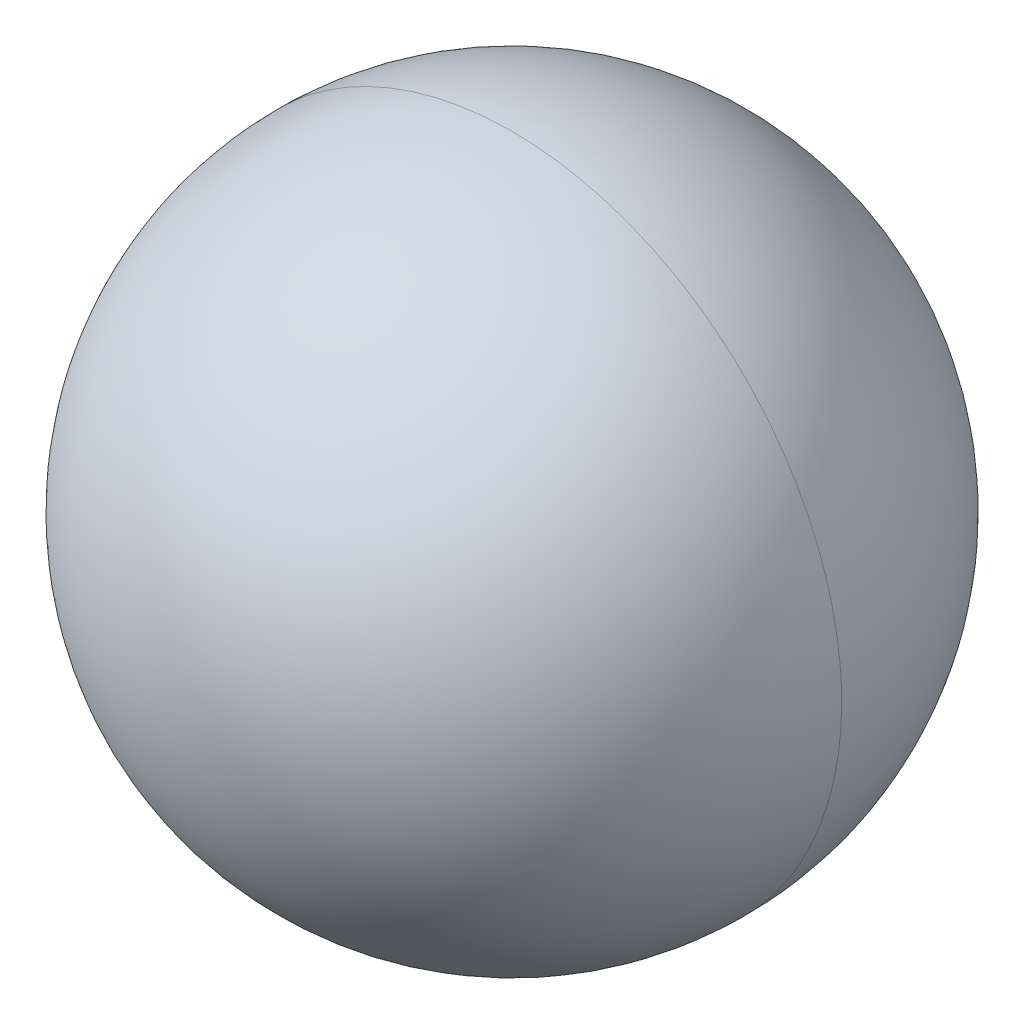
ISO-10303-21;
HEADER;
FILE_DESCRIPTION(('STEP AP214'),'2;1');
FILE_NAME('part.step','',(''),(''),'','','');
FILE_SCHEMA(('AUTOMOTIVE_DESIGN { 1 0 10303 214 1 1 1 1 }'));
ENDSEC;
DATA;
#1=APPLICATION_CONTEXT('core data for automotive mechanical design processes');
#2=APPLICATION_PROTOCOL_DEFINITION('international standard','automotive_design',2000,#1);
#3=PRODUCT_CONTEXT('',#1,'mechanical');
#4=PRODUCT('Part','Part','',(#3));
#5=PRODUCT_RELATED_PRODUCT_CATEGORY('part','',(#4));
#6=PRODUCT_DEFINITION_FORMATION('','',#4);
#7=PRODUCT_DEFINITION_CONTEXT('part definition',#1,'design');
#8=PRODUCT_DEFINITION('design','',#6,#7);
#9=PRODUCT_DEFINITION_SHAPE('','',#8);
#10=(LENGTH_UNIT() NAMED_UNIT(*) SI_UNIT(.MILLI.,.METRE.));
#11=(NAMED_UNIT(*) PLANE_ANGLE_UNIT() SI_UNIT($,.RADIAN.));
#12=(NAMED_UNIT(*) SI_UNIT($,.STERADIAN.) SOLID_ANGLE_UNIT());
#13=UNCERTAINTY_MEASURE_WITH_UNIT(LENGTH_MEASURE(1.E-05),#10,'distance_accuracy_value','');
#14=(GEOMETRIC_REPRESENTATION_CONTEXT(3) GLOBAL_UNCERTAINTY_ASSIGNED_CONTEXT((#13)) GLOBAL_UNIT_ASSIGNED_CONTEXT((#10,
#11,#12)) REPRESENTATION_CONTEXT('',''));
#15=CARTESIAN_POINT('',(0.,0.,0.));
#16=DIRECTION('',(0.,0.,1.));
#17=DIRECTION('',(1.,0.,0.));
#18=AXIS2_PLACEMENT_3D('',#15,#16,#17);
#19=CARTESIAN_POINT('',(0.,0.,0.));
#20=DIRECTION('',(1.,0.,0.));
#21=DIRECTION('',(0.,0.,1.));
#22=AXIS2_PLACEMENT_3D('',#19,#20,#21);
#23=SPHERICAL_SURFACE('',#22,1.2);
#24=CARTESIAN_POINT('',(0.,0.,0.));
#25=DIRECTION('',(0.,0.,1.));
#26=DIRECTION('',(0.,-1.,0.));
#27=AXIS2_PLACEMENT_3D('',#24,#25,#26);
#28=CIRCLE('',#27,1.2);
#29=CARTESIAN_POINT('',(-1.2,0.,0.));
#30=VERTEX_POINT('',#29);
#31=CARTESIAN_POINT('',(1.2,0.,0.));
#32=VERTEX_POINT('',#31);
#33=EDGE_CURVE('E11',#30,#32,#28,.T.);
#34=ORIENTED_EDGE('',*,*,#33,.F.);
#35=CARTESIAN_POINT('',(-1.2,0.,0.));
#36=CARTESIAN_POINT('',(-1.20000041650653,0.0196349739130671,0.));
#37=CARTESIAN_POINT('',(-1.19951810055018,0.0392699123855113,0.));
#38=CARTESIAN_POINT('',(-1.19759099434223,0.0784925060002896,0.));
#39=CARTESIAN_POINT('',(-1.19614620409062,0.0980801611426238,0.));
#40=CARTESIAN_POINT('',(-1.19229713992265,0.137160975648319,0.));
#41=CARTESIAN_POINT('',(-1.18989286600628,0.156654135011681,0.));
#42=CARTESIAN_POINT('',(-1.1841307579092,0.195499003681185,0.));
#43=CARTESIAN_POINT('',(-1.18077292372849,0.214850712987328,0.));
#44=CARTESIAN_POINT('',(-1.17311174923927,0.253366059851378,0.));
#45=CARTESIAN_POINT('',(-1.16880840893076,0.272529697409285,0.));
#46=CARTESIAN_POINT('',(-1.15926659873615,0.310622734358546,0.));
#47=CARTESIAN_POINT('',(-1.15402812885005,0.329552133749898,0.));
#48=CARTESIAN_POINT('',(-1.14262867690725,0.367131091660809,0.));
#49=CARTESIAN_POINT('',(-1.13646769485054,0.385780650180368,0.));
#50=CARTESIAN_POINT('',(-1.12323806158871,0.422754997960958,0.));
#51=CARTESIAN_POINT('',(-1.11616941038359,0.441079787221989,0.));
#52=CARTESIAN_POINT('',(-1.1011414676435,0.477360450454224,0.));
#53=CARTESIAN_POINT('',(-1.09318217610852,0.495316324425427,0.));
#54=CARTESIAN_POINT('',(-1.07639212738775,0.530815899807247,0.));
#55=CARTESIAN_POINT('',(-1.06756137020196,0.548359601217864,0.));
#56=CARTESIAN_POINT('',(-1.04904966423409,0.582992567164527,0.));
#57=CARTESIAN_POINT('',(-1.03936871545202,0.600081831700574,0.));
#58=CARTESIAN_POINT('',(-1.01917994854864,0.633764754363156,0.));
#59=CARTESIAN_POINT('',(-1.00867213042733,0.650358412489693,0.));
#60=CARTESIAN_POINT('',(-0.986854939098781,0.68301014675735,0.));
#61=CARTESIAN_POINT('',(-0.975545565891539,0.699068222898472,0.));
#62=CARTESIAN_POINT('',(-0.952152509662011,0.730610107883366,0.));
#63=CARTESIAN_POINT('',(-0.940068826639724,0.746093916727139,0.));
#64=CARTESIAN_POINT('',(-0.915156261430846,0.776449965265608,0.));
#65=CARTESIAN_POINT('',(-0.902327379244255,0.791322204960303,0.));
#66=CARTESIAN_POINT('',(-0.875955321607649,0.820419286672538,0.));
#67=CARTESIAN_POINT('',(-0.862412146157635,0.834644128690079,0.));
#68=CARTESIAN_POINT('',(-0.834644128690081,0.862412146157633,0.));
#69=CARTESIAN_POINT('',(-0.820419286672541,0.875955321607648,0.));
#70=CARTESIAN_POINT('',(-0.791322204960305,0.902327379244251,0.));
#71=CARTESIAN_POINT('',(-0.77644996526561,0.91515626143084,0.));
#72=CARTESIAN_POINT('',(-0.746093916727142,0.940068826639726,0.));
#73=CARTESIAN_POINT('',(-0.730610107883369,0.952152509662024,0.));
#74=CARTESIAN_POINT('',(-0.699068222898473,0.975545565891521,0.));
#75=CARTESIAN_POINT('',(-0.68301014675735,0.986854939098722,0.));
#76=CARTESIAN_POINT('',(-0.650358412489698,1.00867213042738,0.));
#77=CARTESIAN_POINT('',(-0.633764754363169,1.01917994854885,0.));
#78=CARTESIAN_POINT('',(-0.600081831700566,1.0393687154518,0.));
#79=CARTESIAN_POINT('',(-0.582992567164491,1.0490496642333,0.));
#80=CARTESIAN_POINT('',(-0.548359601217906,1.06756137020275,0.));
#81=CARTESIAN_POINT('',(-0.530815899807396,1.07639212739071,0.));
#82=CARTESIAN_POINT('',(-0.495316324425284,1.09318217610555,0.));
#83=CARTESIAN_POINT('',(-0.477360450453683,1.10114146763243,0.));
#84=CARTESIAN_POINT('',(-0.441079787222536,1.11616941039466,0.));
#85=CARTESIAN_POINT('',(-0.42275499796299,1.12323806163001,0.));
#86=CARTESIAN_POINT('',(-0.385780650178342,1.13646769480923,0.));
#87=CARTESIAN_POINT('',(-0.36713109165324,1.1426286767531,0.));
#88=CARTESIAN_POINT('',(-0.329552133757474,1.1540281290042,0.));
#89=CARTESIAN_POINT('',(-0.310622734386811,1.15926659931144,0.));
#90=CARTESIAN_POINT('',(-0.272529697381027,1.16880840835547,0.));
#91=CARTESIAN_POINT('',(-0.253366059745906,1.17311174709227,0.));
#92=CARTESIAN_POINT('',(-0.214850713092806,1.18077292587548,0.));
#93=CARTESIAN_POINT('',(-0.195499004074827,1.1841307659219,0.));
#94=CARTESIAN_POINT('',(-0.156654134618045,1.18989285799357,0.));
#95=CARTESIAN_POINT('',(-0.137160974179242,1.19229711001882,0.));
#96=CARTESIAN_POINT('',(-0.098080162611708,1.19614623399445,0.));
#97=CARTESIAN_POINT('',(-0.0784925114829768,1.19759110594482,0.));
#98=CARTESIAN_POINT('',(-0.0392699069028313,1.19951798894759,0.));
#99=CARTESIAN_POINT('',(-0.0196349534514168,1.2,0.));
#100=CARTESIAN_POINT('',(0.019634953451412,1.2,0.));
#101=CARTESIAN_POINT('',(0.0392699069028264,1.1995179889476,0.));
#102=CARTESIAN_POINT('',(0.078492511482972,1.19759110594482,0.));
#103=CARTESIAN_POINT('',(0.0980801626117031,1.19614623399445,0.));
#104=CARTESIAN_POINT('',(0.137160974179237,1.19229711001882,0.));
#105=CARTESIAN_POINT('',(0.156654134618041,1.18989285799357,0.));
#106=CARTESIAN_POINT('',(0.195499004074823,1.1841307659219,0.));
#107=CARTESIAN_POINT('',(0.214850713092802,1.18077292587549,0.));
#108=CARTESIAN_POINT('',(0.253366059745901,1.17311174709227,0.));
#109=CARTESIAN_POINT('',(0.272529697381022,1.16880840835547,0.));
#110=CARTESIAN_POINT('',(0.310622734386806,1.15926659931144,0.));
#111=CARTESIAN_POINT('',(0.329552133757469,1.1540281290042,0.));
#112=CARTESIAN_POINT('',(0.367131091653235,1.1426286767531,0.));
#113=CARTESIAN_POINT('',(0.385780650178338,1.13646769480924,0.));
#114=CARTESIAN_POINT('',(0.422754997962986,1.12323806163002,0.));
#115=CARTESIAN_POINT('',(0.441079787222532,1.11616941039466,0.));
#116=CARTESIAN_POINT('',(0.477360450453679,1.10114146763243,0.));
#117=CARTESIAN_POINT('',(0.49531632442528,1.09318217610555,0.));
#118=CARTESIAN_POINT('',(0.530815899807392,1.07639212739071,0.));
#119=CARTESIAN_POINT('',(0.548359601217902,1.06756137020275,0.));
#120=CARTESIAN_POINT('',(0.582992567164487,1.0490496642333,0.));
#121=CARTESIAN_POINT('',(0.600081831700561,1.03936871545181,0.));
#122=CARTESIAN_POINT('',(0.633764754363165,1.01917994854885,0.));
#123=CARTESIAN_POINT('',(0.650358412489694,1.00867213042739,0.));
#124=CARTESIAN_POINT('',(0.683010146757346,0.986854939098724,0.));
#125=CARTESIAN_POINT('',(0.69906822289847,0.975545565891524,0.));
#126=CARTESIAN_POINT('',(0.730610107883366,0.952152509662027,0.));
#127=CARTESIAN_POINT('',(0.746093916727138,0.940068826639729,0.));
#128=CARTESIAN_POINT('',(0.776449965265606,0.915156261430843,0.));
#129=CARTESIAN_POINT('',(0.791322204960302,0.902327379244255,0.));
#130=CARTESIAN_POINT('',(0.820419286672538,0.875955321607651,0.));
#131=CARTESIAN_POINT('',(0.834644128690078,0.862412146157637,0.));
#132=CARTESIAN_POINT('',(0.862412146157632,0.834644128690082,0.));
#133=CARTESIAN_POINT('',(0.875955321607646,0.820419286672542,0.));
#134=CARTESIAN_POINT('',(0.902327379244251,0.791322204960307,0.));
#135=CARTESIAN_POINT('',(0.915156261430843,0.776449965265611,0.));
#136=CARTESIAN_POINT('',(0.940068826639721,0.746093916727143,0.));
#137=CARTESIAN_POINT('',(0.952152509662008,0.730610107883369,0.));
#138=CARTESIAN_POINT('',(0.975545565891536,0.699068222898475,0.));
#139=CARTESIAN_POINT('',(0.986854939098778,0.683010146757354,0.));
#140=CARTESIAN_POINT('',(1.00867213042733,0.650358412489696,0.));
#141=CARTESIAN_POINT('',(1.01917994854863,0.63376475436316,0.));
#142=CARTESIAN_POINT('',(1.03936871545202,0.600081831700578,0.));
#143=CARTESIAN_POINT('',(1.04904966423409,0.582992567164532,0.));
#144=CARTESIAN_POINT('',(1.06756137020196,0.548359601217869,0.));
#145=CARTESIAN_POINT('',(1.07639212738775,0.530815899807252,0.));
#146=CARTESIAN_POINT('',(1.09318217610851,0.495316324425431,0.));
#147=CARTESIAN_POINT('',(1.10114146764349,0.477360450454228,0.));
#148=CARTESIAN_POINT('',(1.11616941038359,0.441079787221993,0.));
#149=CARTESIAN_POINT('',(1.12323806158871,0.422754997960962,0.));
#150=CARTESIAN_POINT('',(1.13646769485054,0.385780650180372,0.));
#151=CARTESIAN_POINT('',(1.14262867690725,0.367131091660813,0.));
#152=CARTESIAN_POINT('',(1.15402812885005,0.329552133749902,0.));
#153=CARTESIAN_POINT('',(1.15926659873615,0.31062273435855,0.));
#154=CARTESIAN_POINT('',(1.16880840893076,0.27252969740929,0.));
#155=CARTESIAN_POINT('',(1.17311174923927,0.253366059851382,0.));
#156=CARTESIAN_POINT('',(1.18077292372849,0.214850712987332,0.));
#157=CARTESIAN_POINT('',(1.1841307579092,0.19549900368119,0.));
#158=CARTESIAN_POINT('',(1.18989286600628,0.156654135011686,0.));
#159=CARTESIAN_POINT('',(1.19229713992265,0.137160975648324,0.));
#160=CARTESIAN_POINT('',(1.19614620409062,0.0980801611426291,0.));
#161=CARTESIAN_POINT('',(1.19759099434223,0.078492506000295,0.));
#162=CARTESIAN_POINT('',(1.19951810055018,0.0392699123855164,0.));
#163=CARTESIAN_POINT('',(1.20000041650653,0.019634973913072,0.));
#164=CARTESIAN_POINT('',(1.2,0.,0.));
#165=B_SPLINE_CURVE_WITH_KNOTS('',3,(#35,#36,#37,#38,#39,#40,#41,#42,#43,#44,#45,#46,#47,#48,
#49,#50,#51,#52,#53,#54,#55,#56,#57,#58,#59,#60,#61,#62,#63,#64,#65,#66,#67,#68,#69,#70,#71,#72,
#73,#74,#75,#76,#77,#78,#79,#80,#81,#82,#83,#84,#85,#86,#87,#88,#89,#90,#91,#92,#93,#94,#95,#96,
#97,#98,#99,#100,#101,#102,#103,#104,#105,#106,#107,#108,#109,#110,#111,#112,#113,#114,#115,
#116,#117,#118,#119,#120,#121,#122,#123,#124,#125,#126,#127,#128,#129,#130,#131,#132,#133,#134,
#135,#136,#137,#138,#139,#140,#141,#142,#143,#144,#145,#146,#147,#148,#149,#150,#151,#152,#153,
#154,#155,#156,#157,#158,#159,#160,#161,#162,#163,#164),.UNSPECIFIED.,.F.,.F.,(4,2,2,2,2,2,2,2,
2,2,2,2,2,2,2,2,2,2,2,2,2,2,2,2,2,2,2,2,2,2,2,2,2,2,2,2,2,2,2,2,2,2,2,2,2,2,2,2,2,2,2,2,2,2,2,2,
2,2,2,2,2,2,2,2,4),(0.,0.0588989484549893,0.117797896909979,0.176696845364968,0.235595793819958,
0.294494742274947,0.353393690729937,0.412292639184926,0.471191587639916,0.530090536094905,
0.588989484549894,0.647888433004884,0.706787381459873,0.765686329914863,0.824585278369852,
0.883484226824842,0.942383175279831,1.00128212373482,1.06018107218981,1.1190800206448,
1.17797896909979,1.23687791755478,1.29577686600977,1.35467581446476,1.41357476291975,
1.47247371137474,1.53137265982973,1.59027160828472,1.6491705567397,1.70806950519469,
1.76696845364968,1.82586740210467,1.88476635055966,1.94366529901465,2.00256424746964,
2.06146319592463,2.12036214437962,2.17926109283461,2.2381600412896,2.29705898974459,
2.35595793819958,2.41485688665457,2.47375583510956,2.53265478356455,2.59155373201954,
2.65045268047453,2.70935162892951,2.7682505773845,2.82714952583949,2.88604847429448,
2.94494742274947,3.00384637120446,3.06274531965945,3.12164426811444,3.18054321656943,
3.23944216502442,3.29834111347941,3.3572400619344,3.41613901038939,3.47503795884438,
3.53393690729937,3.59283585575436,3.65173480420935,3.71063375266433,3.76953270111932),.UNSPECIFIED.);
#166=EDGE_CURVE('E26',#30,#32,#165,.T.);
#167=ORIENTED_EDGE('',*,*,#166,.T.);
#168=EDGE_LOOP('',(#34,#167));
#169=FACE_BOUND('',#168,.T.);
#170=ADVANCED_FACE('F17',(#169),#23,.T.);
#171=CARTESIAN_POINT('',(0.,0.,0.));
#172=DIRECTION('',(1.,0.,0.));
#173=DIRECTION('',(0.,0.,-1.));
#174=AXIS2_PLACEMENT_3D('',#171,#172,#173);
#175=SPHERICAL_SURFACE('',#174,1.2);
#176=ORIENTED_EDGE('',*,*,#33,.T.);
#177=ORIENTED_EDGE('',*,*,#166,.F.);
#178=EDGE_LOOP('',(#176,#177));
#179=FACE_BOUND('',#178,.T.);
#180=ADVANCED_FACE('F36',(#179),#175,.T.);
#181=CLOSED_SHELL('',(#170,#180));
#182=MANIFOLD_SOLID_BREP('B1',#181);
#183=ADVANCED_BREP_SHAPE_REPRESENTATION('',(#18,#182),#14);
#184=SHAPE_DEFINITION_REPRESENTATION(#9,#183);
ENDSEC;
END-ISO-10303-21;
